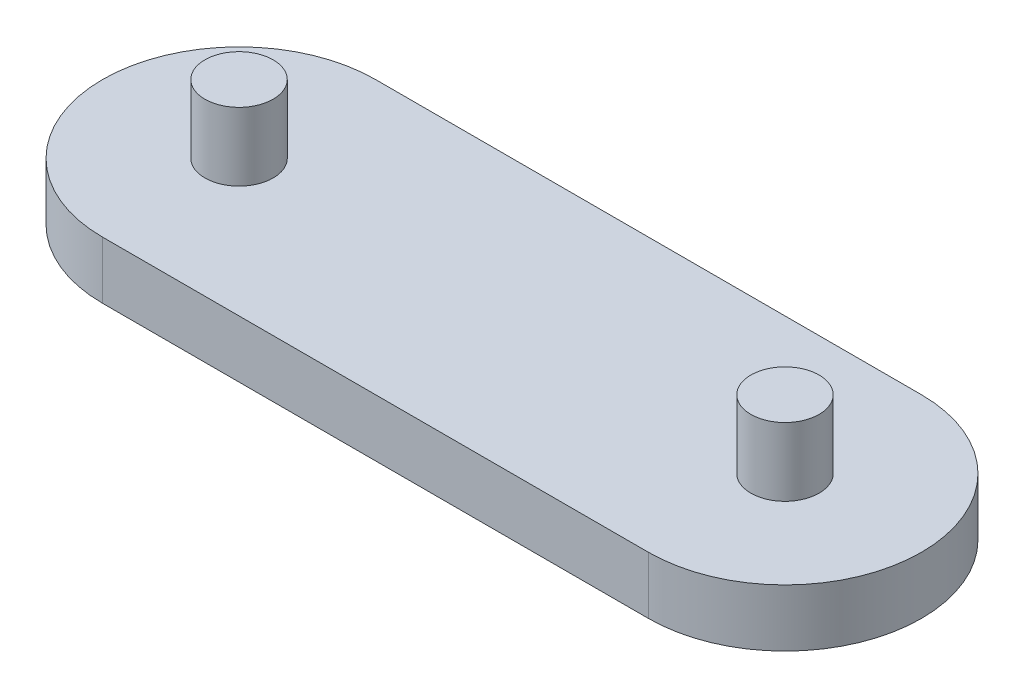
ISO-10303-21;
HEADER;
FILE_DESCRIPTION(('STEP AP214'),'2;1');
FILE_NAME('part.step','',(''),(''),'','','');
FILE_SCHEMA(('AUTOMOTIVE_DESIGN { 1 0 10303 214 1 1 1 1 }'));
ENDSEC;
DATA;
#1=APPLICATION_CONTEXT('core data for automotive mechanical design processes');
#2=APPLICATION_PROTOCOL_DEFINITION('international standard','automotive_design',2000,#1);
#3=PRODUCT_CONTEXT('',#1,'mechanical');
#4=PRODUCT('Part','Part','',(#3));
#5=PRODUCT_RELATED_PRODUCT_CATEGORY('part','',(#4));
#6=PRODUCT_DEFINITION_FORMATION('','',#4);
#7=PRODUCT_DEFINITION_CONTEXT('part definition',#1,'design');
#8=PRODUCT_DEFINITION('design','',#6,#7);
#9=PRODUCT_DEFINITION_SHAPE('','',#8);
#10=(LENGTH_UNIT() NAMED_UNIT(*) SI_UNIT(.MILLI.,.METRE.));
#11=(NAMED_UNIT(*) PLANE_ANGLE_UNIT() SI_UNIT($,.RADIAN.));
#12=(NAMED_UNIT(*) SI_UNIT($,.STERADIAN.) SOLID_ANGLE_UNIT());
#13=UNCERTAINTY_MEASURE_WITH_UNIT(LENGTH_MEASURE(1.E-05),#10,'distance_accuracy_value','');
#14=(GEOMETRIC_REPRESENTATION_CONTEXT(3) GLOBAL_UNCERTAINTY_ASSIGNED_CONTEXT((#13)) GLOBAL_UNIT_ASSIGNED_CONTEXT((#10,
#11,#12)) REPRESENTATION_CONTEXT('',''));
#15=CARTESIAN_POINT('',(0.,0.,0.));
#16=DIRECTION('',(0.,0.,1.));
#17=DIRECTION('',(1.,0.,0.));
#18=AXIS2_PLACEMENT_3D('',#15,#16,#17);
#19=CARTESIAN_POINT('',(0.,42.,0.));
#20=DIRECTION('',(0.,-1.,0.));
#21=DIRECTION('',(0.,0.,-1.));
#22=AXIS2_PLACEMENT_3D('',#19,#20,#21);
#23=CYLINDRICAL_SURFACE('',#22,100.);
#24=CARTESIAN_POINT('',(0.,0.,0.));
#25=DIRECTION('',(0.,1.,0.));
#26=DIRECTION('',(0.,0.,1.));
#27=AXIS2_PLACEMENT_3D('',#24,#25,#26);
#28=CIRCLE('',#27,100.);
#29=CARTESIAN_POINT('',(0.,0.,100.));
#30=VERTEX_POINT('',#29);
#31=CARTESIAN_POINT('',(0.,0.,-100.));
#32=VERTEX_POINT('',#31);
#33=EDGE_CURVE('E107',#30,#32,#28,.T.);
#34=ORIENTED_EDGE('',*,*,#33,.T.);
#35=DIRECTION('',(0.,-1.,0.));
#36=VECTOR('',#35,1.);
#37=CARTESIAN_POINT('',(0.,42.,-100.));
#38=LINE('',#37,#36);
#39=CARTESIAN_POINT('',(0.,42.,-100.));
#40=VERTEX_POINT('',#39);
#41=EDGE_CURVE('E11',#40,#32,#38,.T.);
#42=ORIENTED_EDGE('',*,*,#41,.F.);
#43=CARTESIAN_POINT('',(0.,42.,0.));
#44=DIRECTION('',(0.,1.,0.));
#45=DIRECTION('',(0.,0.,1.));
#46=AXIS2_PLACEMENT_3D('',#43,#44,#45);
#47=CIRCLE('',#46,100.);
#48=CARTESIAN_POINT('',(0.,42.,100.));
#49=VERTEX_POINT('',#48);
#50=EDGE_CURVE('E91',#49,#40,#47,.T.);
#51=ORIENTED_EDGE('',*,*,#50,.F.);
#52=DIRECTION('',(0.,-1.,0.));
#53=VECTOR('',#52,1.);
#54=CARTESIAN_POINT('',(0.,42.,100.));
#55=LINE('',#54,#53);
#56=EDGE_CURVE('E103',#49,#30,#55,.T.);
#57=ORIENTED_EDGE('',*,*,#56,.T.);
#58=EDGE_LOOP('',(#34,#42,#51,#57));
#59=FACE_BOUND('',#58,.T.);
#60=ADVANCED_FACE('F39',(#59),#23,.T.);
#61=CARTESIAN_POINT('',(0.,42.,-100.));
#62=DIRECTION('',(0.,0.,1.));
#63=DIRECTION('',(1.,0.,0.));
#64=AXIS2_PLACEMENT_3D('',#61,#62,#63);
#65=PLANE('',#64);
#66=DIRECTION('',(-1.,0.,0.));
#67=VECTOR('',#66,1.);
#68=CARTESIAN_POINT('',(0.,0.,-100.));
#69=LINE('',#68,#67);
#70=CARTESIAN_POINT('',(-400.,0.,-99.9999999999999));
#71=VERTEX_POINT('',#70);
#72=EDGE_CURVE('E96',#32,#71,#69,.T.);
#73=ORIENTED_EDGE('',*,*,#72,.T.);
#74=DIRECTION('',(0.,-1.,0.));
#75=VECTOR('',#74,1.);
#76=CARTESIAN_POINT('',(-400.,42.,-99.9999999999999));
#77=LINE('',#76,#75);
#78=CARTESIAN_POINT('',(-400.,42.,-99.9999999999999));
#79=VERTEX_POINT('',#78);
#80=EDGE_CURVE('E48',#79,#71,#77,.T.);
#81=ORIENTED_EDGE('',*,*,#80,.F.);
#82=DIRECTION('',(-1.,0.,0.));
#83=VECTOR('',#82,1.);
#84=CARTESIAN_POINT('',(0.,42.,-100.));
#85=LINE('',#84,#83);
#86=EDGE_CURVE('E86',#40,#79,#85,.T.);
#87=ORIENTED_EDGE('',*,*,#86,.F.);
#88=ORIENTED_EDGE('',*,*,#41,.T.);
#89=EDGE_LOOP('',(#73,#81,#87,#88));
#90=FACE_BOUND('',#89,.T.);
#91=ADVANCED_FACE('F95',(#90),#65,.F.);
#92=CARTESIAN_POINT('',(-400.,42.,0.));
#93=DIRECTION('',(0.,-1.,0.));
#94=DIRECTION('',(0.,0.,-1.));
#95=AXIS2_PLACEMENT_3D('',#92,#93,#94);
#96=CYLINDRICAL_SURFACE('',#95,100.);
#97=CARTESIAN_POINT('',(-400.,0.,0.));
#98=DIRECTION('',(0.,1.,0.));
#99=DIRECTION('',(0.,0.,1.));
#100=AXIS2_PLACEMENT_3D('',#97,#98,#99);
#101=CIRCLE('',#100,100.);
#102=CARTESIAN_POINT('',(-400.,0.,100.));
#103=VERTEX_POINT('',#102);
#104=EDGE_CURVE('E73',#71,#103,#101,.T.);
#105=ORIENTED_EDGE('',*,*,#104,.T.);
#106=DIRECTION('',(0.,-1.,0.));
#107=VECTOR('',#106,1.);
#108=CARTESIAN_POINT('',(-400.,42.,100.));
#109=LINE('',#108,#107);
#110=CARTESIAN_POINT('',(-400.,42.,100.));
#111=VERTEX_POINT('',#110);
#112=EDGE_CURVE('E98',#111,#103,#109,.T.);
#113=ORIENTED_EDGE('',*,*,#112,.F.);
#114=CARTESIAN_POINT('',(-400.,42.,0.));
#115=DIRECTION('',(0.,1.,0.));
#116=DIRECTION('',(0.,0.,1.));
#117=AXIS2_PLACEMENT_3D('',#114,#115,#116);
#118=CIRCLE('',#117,100.);
#119=EDGE_CURVE('E89',#79,#111,#118,.T.);
#120=ORIENTED_EDGE('',*,*,#119,.F.);
#121=ORIENTED_EDGE('',*,*,#80,.T.);
#122=EDGE_LOOP('',(#105,#113,#120,#121));
#123=FACE_BOUND('',#122,.T.);
#124=ADVANCED_FACE('F99',(#123),#96,.T.);
#125=CARTESIAN_POINT('',(0.,42.,100.));
#126=DIRECTION('',(0.,0.,-1.));
#127=DIRECTION('',(-1.,0.,0.));
#128=AXIS2_PLACEMENT_3D('',#125,#126,#127);
#129=PLANE('',#128);
#130=DIRECTION('',(1.,0.,0.));
#131=VECTOR('',#130,1.);
#132=CARTESIAN_POINT('',(0.,0.,100.));
#133=LINE('',#132,#131);
#134=EDGE_CURVE('E79',#103,#30,#133,.T.);
#135=ORIENTED_EDGE('',*,*,#134,.T.);
#136=ORIENTED_EDGE('',*,*,#56,.F.);
#137=DIRECTION('',(1.,0.,0.));
#138=VECTOR('',#137,1.);
#139=CARTESIAN_POINT('',(0.,42.,100.));
#140=LINE('',#139,#138);
#141=EDGE_CURVE('E56',#111,#49,#140,.T.);
#142=ORIENTED_EDGE('',*,*,#141,.F.);
#143=ORIENTED_EDGE('',*,*,#112,.T.);
#144=EDGE_LOOP('',(#135,#136,#142,#143));
#145=FACE_BOUND('',#144,.T.);
#146=ADVANCED_FACE('F121',(#145),#129,.F.);
#147=CARTESIAN_POINT('',(0.,42.,0.));
#148=DIRECTION('',(0.,1.,0.));
#149=DIRECTION('',(0.,0.,1.));
#150=AXIS2_PLACEMENT_3D('',#147,#148,#149);
#151=PLANE('',#150);
#152=CARTESIAN_POINT('',(-400.,42.,0.));
#153=DIRECTION('',(0.,1.,0.));
#154=DIRECTION('',(0.,0.,1.));
#155=AXIS2_PLACEMENT_3D('',#152,#153,#154);
#156=CIRCLE('',#155,25.);
#157=CARTESIAN_POINT('',(-400.,42.,25.0000000000001));
#158=VERTEX_POINT('',#157);
#159=EDGE_CURVE('E136',#158,#158,#156,.T.);
#160=ORIENTED_EDGE('',*,*,#159,.F.);
#161=EDGE_LOOP('',(#160));
#162=FACE_BOUND('',#161,.T.);
#163=CARTESIAN_POINT('',(0.,42.,0.));
#164=DIRECTION('',(0.,1.,0.));
#165=DIRECTION('',(0.,0.,1.));
#166=AXIS2_PLACEMENT_3D('',#163,#164,#165);
#167=CIRCLE('',#166,25.);
#168=CARTESIAN_POINT('',(0.,42.,25.));
#169=VERTEX_POINT('',#168);
#170=EDGE_CURVE('E128',#169,#169,#167,.T.);
#171=ORIENTED_EDGE('',*,*,#170,.F.);
#172=EDGE_LOOP('',(#171));
#173=FACE_BOUND('',#172,.T.);
#174=ORIENTED_EDGE('',*,*,#50,.T.);
#175=ORIENTED_EDGE('',*,*,#86,.T.);
#176=ORIENTED_EDGE('',*,*,#119,.T.);
#177=ORIENTED_EDGE('',*,*,#141,.T.);
#178=EDGE_LOOP('',(#174,#175,#176,#177));
#179=FACE_BOUND('',#178,.T.);
#180=ADVANCED_FACE('F87',(#162,#173,#179),#151,.T.);
#181=CARTESIAN_POINT('',(0.,0.,0.));
#182=DIRECTION('',(0.,1.,0.));
#183=DIRECTION('',(0.,0.,1.));
#184=AXIS2_PLACEMENT_3D('',#181,#182,#183);
#185=PLANE('',#184);
#186=ORIENTED_EDGE('',*,*,#33,.F.);
#187=ORIENTED_EDGE('',*,*,#134,.F.);
#188=ORIENTED_EDGE('',*,*,#104,.F.);
#189=ORIENTED_EDGE('',*,*,#72,.F.);
#190=EDGE_LOOP('',(#186,#187,#188,#189));
#191=FACE_BOUND('',#190,.T.);
#192=ADVANCED_FACE('F124',(#191),#185,.F.);
#193=CARTESIAN_POINT('',(0.,92.,0.));
#194=DIRECTION('',(0.,-1.,0.));
#195=DIRECTION('',(0.,0.,-1.));
#196=AXIS2_PLACEMENT_3D('',#193,#194,#195);
#197=CYLINDRICAL_SURFACE('',#196,25.);
#198=CARTESIAN_POINT('',(0.,92.,0.));
#199=DIRECTION('',(0.,1.,0.));
#200=DIRECTION('',(0.,0.,1.));
#201=AXIS2_PLACEMENT_3D('',#198,#199,#200);
#202=CIRCLE('',#201,25.);
#203=CARTESIAN_POINT('',(0.,92.,25.));
#204=VERTEX_POINT('',#203);
#205=EDGE_CURVE('E111',#204,#204,#202,.T.);
#206=ORIENTED_EDGE('',*,*,#205,.F.);
#207=EDGE_LOOP('',(#206));
#208=FACE_BOUND('',#207,.T.);
#209=ORIENTED_EDGE('',*,*,#170,.T.);
#210=EDGE_LOOP('',(#209));
#211=FACE_BOUND('',#210,.T.);
#212=ADVANCED_FACE('F158',(#208,#211),#197,.T.);
#213=CARTESIAN_POINT('',(0.,92.,0.));
#214=DIRECTION('',(0.,1.,0.));
#215=DIRECTION('',(0.,0.,1.));
#216=AXIS2_PLACEMENT_3D('',#213,#214,#215);
#217=PLANE('',#216);
#218=ORIENTED_EDGE('',*,*,#205,.T.);
#219=EDGE_LOOP('',(#218));
#220=FACE_BOUND('',#219,.T.);
#221=ADVANCED_FACE('F149',(#220),#217,.T.);
#222=CARTESIAN_POINT('',(-400.,92.,0.));
#223=DIRECTION('',(0.,-1.,0.));
#224=DIRECTION('',(0.,0.,-1.));
#225=AXIS2_PLACEMENT_3D('',#222,#223,#224);
#226=CYLINDRICAL_SURFACE('',#225,25.);
#227=CARTESIAN_POINT('',(-400.,92.,0.));
#228=DIRECTION('',(0.,1.,0.));
#229=DIRECTION('',(0.,0.,1.));
#230=AXIS2_PLACEMENT_3D('',#227,#228,#229);
#231=CIRCLE('',#230,25.);
#232=CARTESIAN_POINT('',(-400.,92.,25.0000000000001));
#233=VERTEX_POINT('',#232);
#234=EDGE_CURVE('E132',#233,#233,#231,.T.);
#235=ORIENTED_EDGE('',*,*,#234,.F.);
#236=EDGE_LOOP('',(#235));
#237=FACE_BOUND('',#236,.T.);
#238=ORIENTED_EDGE('',*,*,#159,.T.);
#239=EDGE_LOOP('',(#238));
#240=FACE_BOUND('',#239,.T.);
#241=ADVANCED_FACE('F146',(#237,#240),#226,.T.);
#242=CARTESIAN_POINT('',(-400.,92.,0.));
#243=DIRECTION('',(0.,1.,0.));
#244=DIRECTION('',(0.,0.,1.));
#245=AXIS2_PLACEMENT_3D('',#242,#243,#244);
#246=PLANE('',#245);
#247=ORIENTED_EDGE('',*,*,#234,.T.);
#248=EDGE_LOOP('',(#247));
#249=FACE_BOUND('',#248,.T.);
#250=ADVANCED_FACE('F144',(#249),#246,.T.);
#251=CLOSED_SHELL('',(#60,#91,#124,#146,#180,#192,#212,#221,#241,#250));
#252=MANIFOLD_SOLID_BREP('B2',#251);
#253=ADVANCED_BREP_SHAPE_REPRESENTATION('',(#18,#252),#14);
#254=SHAPE_DEFINITION_REPRESENTATION(#9,#253);
ENDSEC;
END-ISO-10303-21;
